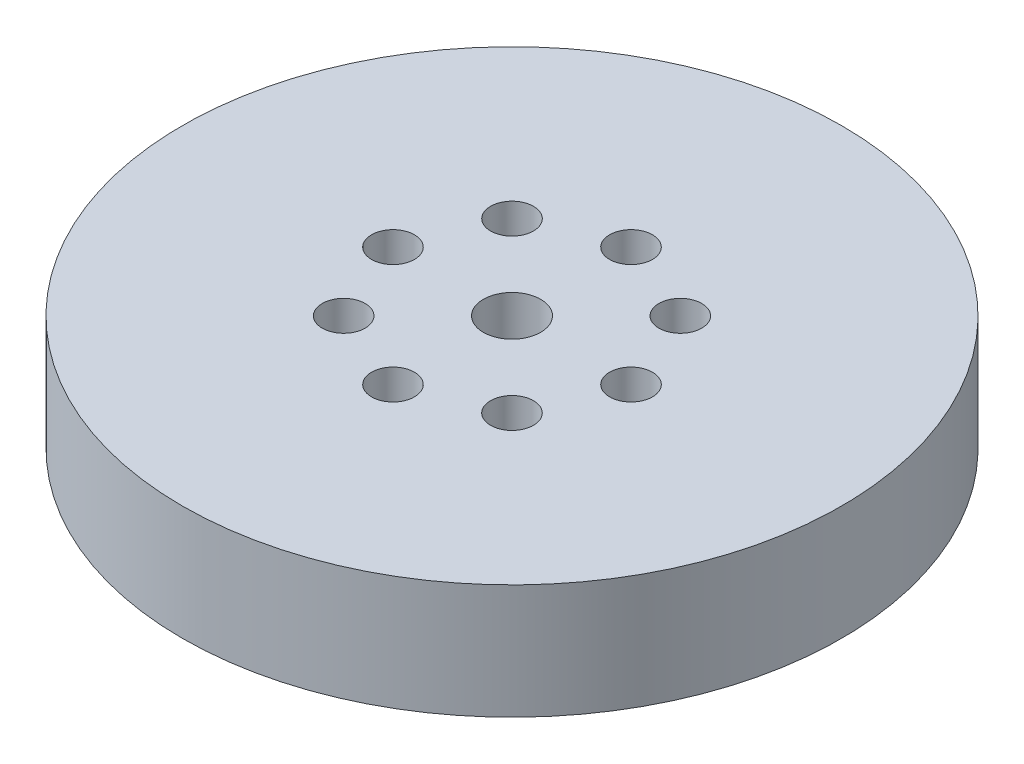
ISO-10303-21;
HEADER;
FILE_DESCRIPTION(('STEP AP214'),'2;1');
FILE_NAME('part.step','',(''),(''),'','','');
FILE_SCHEMA(('AUTOMOTIVE_DESIGN { 1 0 10303 214 1 1 1 1 }'));
ENDSEC;
DATA;
#1=APPLICATION_CONTEXT('core data for automotive mechanical design processes');
#2=APPLICATION_PROTOCOL_DEFINITION('international standard','automotive_design',2000,#1);
#3=PRODUCT_CONTEXT('',#1,'mechanical');
#4=PRODUCT('Part','Part','',(#3));
#5=PRODUCT_RELATED_PRODUCT_CATEGORY('part','',(#4));
#6=PRODUCT_DEFINITION_FORMATION('','',#4);
#7=PRODUCT_DEFINITION_CONTEXT('part definition',#1,'design');
#8=PRODUCT_DEFINITION('design','',#6,#7);
#9=PRODUCT_DEFINITION_SHAPE('','',#8);
#10=(LENGTH_UNIT() NAMED_UNIT(*) SI_UNIT(.MILLI.,.METRE.));
#11=(NAMED_UNIT(*) PLANE_ANGLE_UNIT() SI_UNIT($,.RADIAN.));
#12=(NAMED_UNIT(*) SI_UNIT($,.STERADIAN.) SOLID_ANGLE_UNIT());
#13=UNCERTAINTY_MEASURE_WITH_UNIT(LENGTH_MEASURE(1.E-05),#10,'distance_accuracy_value','');
#14=(GEOMETRIC_REPRESENTATION_CONTEXT(3) GLOBAL_UNCERTAINTY_ASSIGNED_CONTEXT((#13)) GLOBAL_UNIT_ASSIGNED_CONTEXT((#10,
#11,#12)) REPRESENTATION_CONTEXT('',''));
#15=CARTESIAN_POINT('',(0.,0.,0.));
#16=DIRECTION('',(0.,0.,1.));
#17=DIRECTION('',(1.,0.,0.));
#18=AXIS2_PLACEMENT_3D('',#15,#16,#17);
#19=CARTESIAN_POINT('',(0.,20.,0.));
#20=DIRECTION('',(0.,-1.,0.));
#21=DIRECTION('',(0.,0.,-1.));
#22=AXIS2_PLACEMENT_3D('',#19,#20,#21);
#23=CYLINDRICAL_SURFACE('',#22,57.5);
#24=CARTESIAN_POINT('',(0.,20.,0.));
#25=DIRECTION('',(0.,1.,0.));
#26=DIRECTION('',(0.,0.,1.));
#27=AXIS2_PLACEMENT_3D('',#24,#25,#26);
#28=CIRCLE('',#27,57.5);
#29=CARTESIAN_POINT('',(0.,20.,57.5));
#30=VERTEX_POINT('',#29);
#31=EDGE_CURVE('E10',#30,#30,#28,.T.);
#32=ORIENTED_EDGE('',*,*,#31,.F.);
#33=EDGE_LOOP('',(#32));
#34=FACE_BOUND('',#33,.T.);
#35=CARTESIAN_POINT('',(0.,0.,0.));
#36=DIRECTION('',(0.,1.,0.));
#37=DIRECTION('',(0.,0.,1.));
#38=AXIS2_PLACEMENT_3D('',#35,#36,#37);
#39=CIRCLE('',#38,57.5);
#40=CARTESIAN_POINT('',(0.,0.,57.5));
#41=VERTEX_POINT('',#40);
#42=EDGE_CURVE('E37',#41,#41,#39,.T.);
#43=ORIENTED_EDGE('',*,*,#42,.T.);
#44=EDGE_LOOP('',(#43));
#45=FACE_BOUND('',#44,.T.);
#46=ADVANCED_FACE('F40',(#34,#45),#23,.T.);
#47=CARTESIAN_POINT('',(0.,20.,0.));
#48=DIRECTION('',(0.,1.,0.));
#49=DIRECTION('',(0.,0.,1.));
#50=AXIS2_PLACEMENT_3D('',#47,#48,#49);
#51=PLANE('',#50);
#52=CARTESIAN_POINT('',(0.,20.,20.7652597096898));
#53=DIRECTION('',(0.,1.,0.));
#54=DIRECTION('',(1.,0.,0.));
#55=AXIS2_PLACEMENT_3D('',#52,#53,#54);
#56=CIRCLE('',#55,3.7397131081847);
#57=CARTESIAN_POINT('',(3.73971310818477,20.,20.7652597096898));
#58=VERTEX_POINT('',#57);
#59=EDGE_CURVE('E88',#58,#58,#56,.T.);
#60=ORIENTED_EDGE('',*,*,#59,.F.);
#61=EDGE_LOOP('',(#60));
#62=FACE_BOUND('',#61,.T.);
#63=CARTESIAN_POINT('',(14.6832559538216,20.,14.6832559538214));
#64=DIRECTION('',(0.,1.,0.));
#65=DIRECTION('',(0.707106781186544,0.,-0.707106781186551));
#66=AXIS2_PLACEMENT_3D('',#63,#64,#65);
#67=CIRCLE('',#66,3.7397131081847);
#68=CARTESIAN_POINT('',(17.3276324523112,20.,12.0388794553318));
#69=VERTEX_POINT('',#68);
#70=EDGE_CURVE('E79',#69,#69,#67,.T.);
#71=ORIENTED_EDGE('',*,*,#70,.F.);
#72=EDGE_LOOP('',(#71));
#73=FACE_BOUND('',#72,.T.);
#74=CARTESIAN_POINT('',(20.7652597096898,20.,0.));
#75=DIRECTION('',(0.,1.,0.));
#76=DIRECTION('',(0.,0.,-1.));
#77=AXIS2_PLACEMENT_3D('',#74,#75,#76);
#78=CIRCLE('',#77,3.7397131081847);
#79=CARTESIAN_POINT('',(20.7652597096898,20.,-3.7397131081847));
#80=VERTEX_POINT('',#79);
#81=EDGE_CURVE('E74',#80,#80,#78,.T.);
#82=ORIENTED_EDGE('',*,*,#81,.F.);
#83=EDGE_LOOP('',(#82));
#84=FACE_BOUND('',#83,.T.);
#85=CARTESIAN_POINT('',(14.6832559538213,20.,-14.6832559538216));
#86=DIRECTION('',(0.,1.,0.));
#87=DIRECTION('',(-0.707106781186554,0.,-0.707106781186541));
#88=AXIS2_PLACEMENT_3D('',#85,#86,#87);
#89=CIRCLE('',#88,3.7397131081847);
#90=CARTESIAN_POINT('',(12.0388794553317,20.,-17.3276324523112));
#91=VERTEX_POINT('',#90);
#92=EDGE_CURVE('E70',#91,#91,#89,.T.);
#93=ORIENTED_EDGE('',*,*,#92,.F.);
#94=EDGE_LOOP('',(#93));
#95=FACE_BOUND('',#94,.T.);
#96=CARTESIAN_POINT('',(-2.1750455031784E-13,20.,-20.7652597096898));
#97=DIRECTION('',(0.,1.,0.));
#98=DIRECTION('',(-1.,0.,0.));
#99=AXIS2_PLACEMENT_3D('',#96,#97,#98);
#100=CIRCLE('',#99,3.7397131081847);
#101=CARTESIAN_POINT('',(-3.73971310818492,20.,-20.7652597096898));
#102=VERTEX_POINT('',#101);
#103=EDGE_CURVE('E100',#102,#102,#100,.T.);
#104=ORIENTED_EDGE('',*,*,#103,.F.);
#105=EDGE_LOOP('',(#104));
#106=FACE_BOUND('',#105,.T.);
#107=CARTESIAN_POINT('',(-14.6832559538217,20.,-14.6832559538213));
#108=DIRECTION('',(0.,1.,0.));
#109=DIRECTION('',(-0.707106781186539,0.,0.707106781186556));
#110=AXIS2_PLACEMENT_3D('',#107,#108,#109);
#111=CIRCLE('',#110,3.7397131081847);
#112=CARTESIAN_POINT('',(-17.3276324523112,20.,-12.0388794553316));
#113=VERTEX_POINT('',#112);
#114=EDGE_CURVE('E93',#113,#113,#111,.T.);
#115=ORIENTED_EDGE('',*,*,#114,.F.);
#116=EDGE_LOOP('',(#115));
#117=FACE_BOUND('',#116,.T.);
#118=CARTESIAN_POINT('',(-14.6832559538215,20.,14.6832559538215));
#119=DIRECTION('',(0.,1.,0.));
#120=DIRECTION('',(0.707106781186549,0.,0.707106781186546));
#121=AXIS2_PLACEMENT_3D('',#118,#119,#120);
#122=CIRCLE('',#121,3.7397131081847);
#123=CARTESIAN_POINT('',(-12.0388794553318,20.,17.3276324523111));
#124=VERTEX_POINT('',#123);
#125=EDGE_CURVE('E61',#124,#124,#122,.T.);
#126=ORIENTED_EDGE('',*,*,#125,.F.);
#127=EDGE_LOOP('',(#126));
#128=FACE_BOUND('',#127,.T.);
#129=CARTESIAN_POINT('',(-20.7652597096898,20.,0.));
#130=DIRECTION('',(0.,1.,0.));
#131=DIRECTION('',(0.,0.,1.));
#132=AXIS2_PLACEMENT_3D('',#129,#130,#131);
#133=CIRCLE('',#132,3.7397131081847);
#134=CARTESIAN_POINT('',(-20.7652597096898,20.,3.7397131081847));
#135=VERTEX_POINT('',#134);
#136=EDGE_CURVE('E54',#135,#135,#133,.T.);
#137=ORIENTED_EDGE('',*,*,#136,.F.);
#138=EDGE_LOOP('',(#137));
#139=FACE_BOUND('',#138,.T.);
#140=CARTESIAN_POINT('',(0.,20.,0.));
#141=DIRECTION('',(0.,1.,0.));
#142=DIRECTION('',(0.,0.,1.));
#143=AXIS2_PLACEMENT_3D('',#140,#141,#142);
#144=CIRCLE('',#143,5.);
#145=CARTESIAN_POINT('',(0.,20.,5.));
#146=VERTEX_POINT('',#145);
#147=EDGE_CURVE('E50',#146,#146,#144,.T.);
#148=ORIENTED_EDGE('',*,*,#147,.F.);
#149=EDGE_LOOP('',(#148));
#150=FACE_BOUND('',#149,.T.);
#151=ORIENTED_EDGE('',*,*,#31,.T.);
#152=EDGE_LOOP('',(#151));
#153=FACE_BOUND('',#152,.T.);
#154=ADVANCED_FACE('F115',(#62,#73,#84,#95,#106,#117,#128,#139,#150,#153),#51,.T.);
#155=CARTESIAN_POINT('',(0.,0.,0.));
#156=DIRECTION('',(0.,1.,0.));
#157=DIRECTION('',(0.,0.,1.));
#158=AXIS2_PLACEMENT_3D('',#155,#156,#157);
#159=PLANE('',#158);
#160=CARTESIAN_POINT('',(0.,0.,0.));
#161=DIRECTION('',(0.,1.,0.));
#162=DIRECTION('',(0.,0.,1.));
#163=AXIS2_PLACEMENT_3D('',#160,#161,#162);
#164=CIRCLE('',#163,5.);
#165=CARTESIAN_POINT('',(0.,0.,5.));
#166=VERTEX_POINT('',#165);
#167=EDGE_CURVE('E47',#166,#166,#164,.T.);
#168=ORIENTED_EDGE('',*,*,#167,.T.);
#169=EDGE_LOOP('',(#168));
#170=FACE_BOUND('',#169,.T.);
#171=ORIENTED_EDGE('',*,*,#42,.F.);
#172=EDGE_LOOP('',(#171));
#173=FACE_BOUND('',#172,.T.);
#174=ADVANCED_FACE('F113',(#170,#173),#159,.F.);
#175=CARTESIAN_POINT('',(0.,20.,0.));
#176=DIRECTION('',(0.,-1.,0.));
#177=DIRECTION('',(0.,0.,-1.));
#178=AXIS2_PLACEMENT_3D('',#175,#176,#177);
#179=CYLINDRICAL_SURFACE('',#178,5.);
#180=ORIENTED_EDGE('',*,*,#147,.T.);
#181=EDGE_LOOP('',(#180));
#182=FACE_BOUND('',#181,.T.);
#183=ORIENTED_EDGE('',*,*,#167,.F.);
#184=EDGE_LOOP('',(#183));
#185=FACE_BOUND('',#184,.T.);
#186=ADVANCED_FACE('F127',(#182,#185),#179,.F.);
#187=CARTESIAN_POINT('',(-20.7652597096898,0.921798365533515,0.));
#188=DIRECTION('',(0.,1.,0.));
#189=DIRECTION('',(0.,0.,1.));
#190=AXIS2_PLACEMENT_3D('',#187,#188,#189);
#191=CYLINDRICAL_SURFACE('',#190,3.7397131081847);
#192=CARTESIAN_POINT('',(-20.7652597096898,0.921798365533515,0.));
#193=DIRECTION('',(0.,1.,0.));
#194=DIRECTION('',(0.,0.,1.));
#195=AXIS2_PLACEMENT_3D('',#192,#193,#194);
#196=CIRCLE('',#195,3.7397131081847);
#197=CARTESIAN_POINT('',(-20.7652597096898,0.921798365533515,3.7397131081847));
#198=VERTEX_POINT('',#197);
#199=EDGE_CURVE('E55',#198,#198,#196,.T.);
#200=ORIENTED_EDGE('',*,*,#199,.F.);
#201=EDGE_LOOP('',(#200));
#202=FACE_BOUND('',#201,.T.);
#203=ORIENTED_EDGE('',*,*,#136,.T.);
#204=EDGE_LOOP('',(#203));
#205=FACE_BOUND('',#204,.T.);
#206=ADVANCED_FACE('F129',(#202,#205),#191,.F.);
#207=CARTESIAN_POINT('',(-20.7652597096898,0.921798365533515,0.));
#208=DIRECTION('',(0.,1.,0.));
#209=DIRECTION('',(0.,0.,1.));
#210=AXIS2_PLACEMENT_3D('',#207,#208,#209);
#211=PLANE('',#210);
#212=ORIENTED_EDGE('',*,*,#199,.T.);
#213=EDGE_LOOP('',(#212));
#214=FACE_BOUND('',#213,.T.);
#215=ADVANCED_FACE('F157',(#214),#211,.T.);
#216=CARTESIAN_POINT('',(-14.6832559538215,0.921798365533515,14.6832559538215));
#217=DIRECTION('',(0.,1.,0.));
#218=DIRECTION('',(0.,0.,1.));
#219=AXIS2_PLACEMENT_3D('',#216,#217,#218);
#220=CYLINDRICAL_SURFACE('',#219,3.7397131081847);
#221=CARTESIAN_POINT('',(-14.6832559538215,0.921798365533515,14.6832559538215));
#222=DIRECTION('',(0.,1.,0.));
#223=DIRECTION('',(0.707106781186549,0.,0.707106781186546));
#224=AXIS2_PLACEMENT_3D('',#221,#222,#223);
#225=CIRCLE('',#224,3.7397131081847);
#226=CARTESIAN_POINT('',(-12.0388794553318,0.921798365533515,17.3276324523111));
#227=VERTEX_POINT('',#226);
#228=EDGE_CURVE('E59',#227,#227,#225,.T.);
#229=ORIENTED_EDGE('',*,*,#228,.F.);
#230=EDGE_LOOP('',(#229));
#231=FACE_BOUND('',#230,.T.);
#232=ORIENTED_EDGE('',*,*,#125,.T.);
#233=EDGE_LOOP('',(#232));
#234=FACE_BOUND('',#233,.T.);
#235=ADVANCED_FACE('F170',(#231,#234),#220,.F.);
#236=CARTESIAN_POINT('',(-14.6832559538215,0.921798365533515,14.6832559538215));
#237=DIRECTION('',(0.,1.,0.));
#238=DIRECTION('',(0.707106781186549,0.,0.707106781186546));
#239=AXIS2_PLACEMENT_3D('',#236,#237,#238);
#240=PLANE('',#239);
#241=ORIENTED_EDGE('',*,*,#228,.T.);
#242=EDGE_LOOP('',(#241));
#243=FACE_BOUND('',#242,.T.);
#244=ADVANCED_FACE('F182',(#243),#240,.T.);
#245=CARTESIAN_POINT('',(-14.6832559538217,0.921798365533515,-14.6832559538213));
#246=DIRECTION('',(0.,1.,0.));
#247=DIRECTION('',(0.,0.,1.));
#248=AXIS2_PLACEMENT_3D('',#245,#246,#247);
#249=CYLINDRICAL_SURFACE('',#248,3.7397131081847);
#250=CARTESIAN_POINT('',(-14.6832559538217,0.921798365533515,-14.6832559538213));
#251=DIRECTION('',(0.,1.,0.));
#252=DIRECTION('',(-0.707106781186539,0.,0.707106781186556));
#253=AXIS2_PLACEMENT_3D('',#250,#251,#252);
#254=CIRCLE('',#253,3.7397131081847);
#255=CARTESIAN_POINT('',(-17.3276324523112,0.921798365533515,-12.0388794553316));
#256=VERTEX_POINT('',#255);
#257=EDGE_CURVE('E94',#256,#256,#254,.T.);
#258=ORIENTED_EDGE('',*,*,#257,.F.);
#259=EDGE_LOOP('',(#258));
#260=FACE_BOUND('',#259,.T.);
#261=ORIENTED_EDGE('',*,*,#114,.T.);
#262=EDGE_LOOP('',(#261));
#263=FACE_BOUND('',#262,.T.);
#264=ADVANCED_FACE('F189',(#260,#263),#249,.F.);
#265=CARTESIAN_POINT('',(-14.6832559538217,0.921798365533515,-14.6832559538213));
#266=DIRECTION('',(0.,1.,0.));
#267=DIRECTION('',(-0.707106781186539,0.,0.707106781186556));
#268=AXIS2_PLACEMENT_3D('',#265,#266,#267);
#269=PLANE('',#268);
#270=ORIENTED_EDGE('',*,*,#257,.T.);
#271=EDGE_LOOP('',(#270));
#272=FACE_BOUND('',#271,.T.);
#273=ADVANCED_FACE('F107',(#272),#269,.T.);
#274=CARTESIAN_POINT('',(-2.1750455031784E-13,0.921798365533515,-20.7652597096898));
#275=DIRECTION('',(0.,1.,0.));
#276=DIRECTION('',(0.,0.,1.));
#277=AXIS2_PLACEMENT_3D('',#274,#275,#276);
#278=CYLINDRICAL_SURFACE('',#277,3.7397131081847);
#279=CARTESIAN_POINT('',(-2.1750455031784E-13,0.921798365533515,-20.7652597096898));
#280=DIRECTION('',(0.,1.,0.));
#281=DIRECTION('',(-1.,0.,0.));
#282=AXIS2_PLACEMENT_3D('',#279,#280,#281);
#283=CIRCLE('',#282,3.7397131081847);
#284=CARTESIAN_POINT('',(-3.73971310818492,0.921798365533515,-20.7652597096898));
#285=VERTEX_POINT('',#284);
#286=EDGE_CURVE('E72',#285,#285,#283,.T.);
#287=ORIENTED_EDGE('',*,*,#286,.F.);
#288=EDGE_LOOP('',(#287));
#289=FACE_BOUND('',#288,.T.);
#290=ORIENTED_EDGE('',*,*,#103,.T.);
#291=EDGE_LOOP('',(#290));
#292=FACE_BOUND('',#291,.T.);
#293=ADVANCED_FACE('F104',(#289,#292),#278,.F.);
#294=CARTESIAN_POINT('',(-2.1750455031784E-13,0.921798365533515,-20.7652597096898));
#295=DIRECTION('',(0.,1.,0.));
#296=DIRECTION('',(-1.,0.,0.));
#297=AXIS2_PLACEMENT_3D('',#294,#295,#296);
#298=PLANE('',#297);
#299=ORIENTED_EDGE('',*,*,#286,.T.);
#300=EDGE_LOOP('',(#299));
#301=FACE_BOUND('',#300,.T.);
#302=ADVANCED_FACE('F103',(#301),#298,.T.);
#303=CARTESIAN_POINT('',(14.6832559538213,0.921798365533515,-14.6832559538216));
#304=DIRECTION('',(0.,1.,0.));
#305=DIRECTION('',(0.,0.,1.));
#306=AXIS2_PLACEMENT_3D('',#303,#304,#305);
#307=CYLINDRICAL_SURFACE('',#306,3.7397131081847);
#308=CARTESIAN_POINT('',(14.6832559538213,0.921798365533515,-14.6832559538216));
#309=DIRECTION('',(0.,1.,0.));
#310=DIRECTION('',(-0.707106781186554,0.,-0.707106781186541));
#311=AXIS2_PLACEMENT_3D('',#308,#309,#310);
#312=CIRCLE('',#311,3.7397131081847);
#313=CARTESIAN_POINT('',(12.0388794553317,0.921798365533515,-17.3276324523112));
#314=VERTEX_POINT('',#313);
#315=EDGE_CURVE('E69',#314,#314,#312,.T.);
#316=ORIENTED_EDGE('',*,*,#315,.F.);
#317=EDGE_LOOP('',(#316));
#318=FACE_BOUND('',#317,.T.);
#319=ORIENTED_EDGE('',*,*,#92,.T.);
#320=EDGE_LOOP('',(#319));
#321=FACE_BOUND('',#320,.T.);
#322=ADVANCED_FACE('F219',(#318,#321),#307,.F.);
#323=CARTESIAN_POINT('',(14.6832559538213,0.921798365533515,-14.6832559538216));
#324=DIRECTION('',(0.,1.,0.));
#325=DIRECTION('',(-0.707106781186554,0.,-0.707106781186541));
#326=AXIS2_PLACEMENT_3D('',#323,#324,#325);
#327=PLANE('',#326);
#328=ORIENTED_EDGE('',*,*,#315,.T.);
#329=EDGE_LOOP('',(#328));
#330=FACE_BOUND('',#329,.T.);
#331=ADVANCED_FACE('F227',(#330),#327,.T.);
#332=CARTESIAN_POINT('',(20.7652597096898,0.921798365533515,0.));
#333=DIRECTION('',(0.,1.,0.));
#334=DIRECTION('',(0.,0.,1.));
#335=AXIS2_PLACEMENT_3D('',#332,#333,#334);
#336=CYLINDRICAL_SURFACE('',#335,3.7397131081847);
#337=CARTESIAN_POINT('',(20.7652597096898,0.921798365533515,0.));
#338=DIRECTION('',(0.,1.,0.));
#339=DIRECTION('',(0.,0.,-1.));
#340=AXIS2_PLACEMENT_3D('',#337,#338,#339);
#341=CIRCLE('',#340,3.7397131081847);
#342=CARTESIAN_POINT('',(20.7652597096898,0.921798365533515,-3.7397131081847));
#343=VERTEX_POINT('',#342);
#344=EDGE_CURVE('E80',#343,#343,#341,.T.);
#345=ORIENTED_EDGE('',*,*,#344,.F.);
#346=EDGE_LOOP('',(#345));
#347=FACE_BOUND('',#346,.T.);
#348=ORIENTED_EDGE('',*,*,#81,.T.);
#349=EDGE_LOOP('',(#348));
#350=FACE_BOUND('',#349,.T.);
#351=ADVANCED_FACE('F240',(#347,#350),#336,.F.);
#352=CARTESIAN_POINT('',(20.7652597096898,0.921798365533515,0.));
#353=DIRECTION('',(0.,1.,0.));
#354=DIRECTION('',(0.,0.,-1.));
#355=AXIS2_PLACEMENT_3D('',#352,#353,#354);
#356=PLANE('',#355);
#357=ORIENTED_EDGE('',*,*,#344,.T.);
#358=EDGE_LOOP('',(#357));
#359=FACE_BOUND('',#358,.T.);
#360=ADVANCED_FACE('F246',(#359),#356,.T.);
#361=CARTESIAN_POINT('',(14.6832559538216,0.921798365533515,14.6832559538214));
#362=DIRECTION('',(0.,1.,0.));
#363=DIRECTION('',(0.,0.,1.));
#364=AXIS2_PLACEMENT_3D('',#361,#362,#363);
#365=CYLINDRICAL_SURFACE('',#364,3.7397131081847);
#366=CARTESIAN_POINT('',(14.6832559538216,0.921798365533515,14.6832559538214));
#367=DIRECTION('',(0.,1.,0.));
#368=DIRECTION('',(0.707106781186544,0.,-0.707106781186551));
#369=AXIS2_PLACEMENT_3D('',#366,#367,#368);
#370=CIRCLE('',#369,3.7397131081847);
#371=CARTESIAN_POINT('',(17.3276324523112,0.921798365533515,12.0388794553318));
#372=VERTEX_POINT('',#371);
#373=EDGE_CURVE('E82',#372,#372,#370,.T.);
#374=ORIENTED_EDGE('',*,*,#373,.F.);
#375=EDGE_LOOP('',(#374));
#376=FACE_BOUND('',#375,.T.);
#377=ORIENTED_EDGE('',*,*,#70,.T.);
#378=EDGE_LOOP('',(#377));
#379=FACE_BOUND('',#378,.T.);
#380=ADVANCED_FACE('F254',(#376,#379),#365,.F.);
#381=CARTESIAN_POINT('',(14.6832559538216,0.921798365533515,14.6832559538214));
#382=DIRECTION('',(0.,1.,0.));
#383=DIRECTION('',(0.707106781186544,0.,-0.707106781186551));
#384=AXIS2_PLACEMENT_3D('',#381,#382,#383);
#385=PLANE('',#384);
#386=ORIENTED_EDGE('',*,*,#373,.T.);
#387=EDGE_LOOP('',(#386));
#388=FACE_BOUND('',#387,.T.);
#389=ADVANCED_FACE('F262',(#388),#385,.T.);
#390=CARTESIAN_POINT('',(0.,0.921798365533515,20.7652597096898));
#391=DIRECTION('',(0.,1.,0.));
#392=DIRECTION('',(0.,0.,1.));
#393=AXIS2_PLACEMENT_3D('',#390,#391,#392);
#394=CYLINDRICAL_SURFACE('',#393,3.7397131081847);
#395=CARTESIAN_POINT('',(0.,0.921798365533515,20.7652597096898));
#396=DIRECTION('',(0.,1.,0.));
#397=DIRECTION('',(1.,0.,0.));
#398=AXIS2_PLACEMENT_3D('',#395,#396,#397);
#399=CIRCLE('',#398,3.7397131081847);
#400=CARTESIAN_POINT('',(3.73971310818477,0.921798365533515,20.7652597096898));
#401=VERTEX_POINT('',#400);
#402=EDGE_CURVE('E63',#401,#401,#399,.T.);
#403=ORIENTED_EDGE('',*,*,#402,.F.);
#404=EDGE_LOOP('',(#403));
#405=FACE_BOUND('',#404,.T.);
#406=ORIENTED_EDGE('',*,*,#59,.T.);
#407=EDGE_LOOP('',(#406));
#408=FACE_BOUND('',#407,.T.);
#409=ADVANCED_FACE('F272',(#405,#408),#394,.F.);
#410=CARTESIAN_POINT('',(0.,0.921798365533515,20.7652597096898));
#411=DIRECTION('',(0.,1.,0.));
#412=DIRECTION('',(1.,0.,0.));
#413=AXIS2_PLACEMENT_3D('',#410,#411,#412);
#414=PLANE('',#413);
#415=ORIENTED_EDGE('',*,*,#402,.T.);
#416=EDGE_LOOP('',(#415));
#417=FACE_BOUND('',#416,.T.);
#418=ADVANCED_FACE('F285',(#417),#414,.T.);
#419=CLOSED_SHELL('',(#46,#154,#174,#186,#206,#215,#235,#244,#264,#273,#293,#302,#322,#331,#351,
#360,#380,#389,#409,#418));
#420=MANIFOLD_SOLID_BREP('B2',#419);
#421=ADVANCED_BREP_SHAPE_REPRESENTATION('',(#18,#420),#14);
#422=SHAPE_DEFINITION_REPRESENTATION(#9,#421);
ENDSEC;
END-ISO-10303-21;
